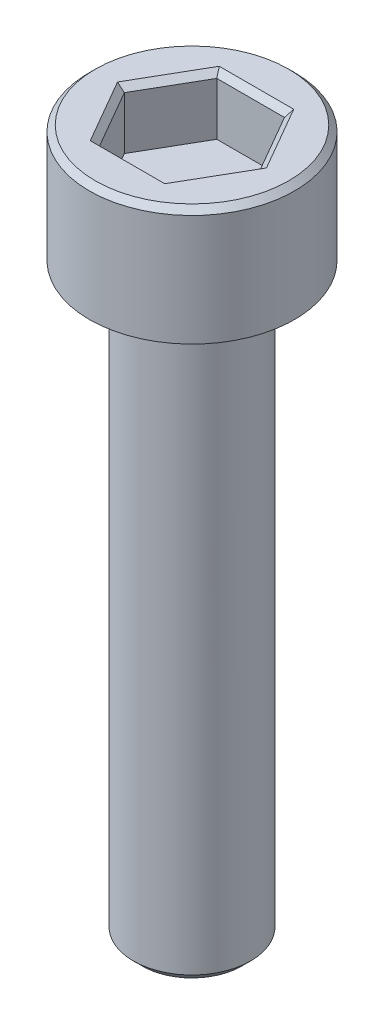
ISO-10303-21;
HEADER;
FILE_DESCRIPTION(('STEP AP214'),'2;1');
FILE_NAME('part.step','',(''),(''),'','','');
FILE_SCHEMA(('AUTOMOTIVE_DESIGN { 1 0 10303 214 1 1 1 1 }'));
ENDSEC;
DATA;
#1=APPLICATION_CONTEXT('core data for automotive mechanical design processes');
#2=APPLICATION_PROTOCOL_DEFINITION('international standard','automotive_design',2000,#1);
#3=PRODUCT_CONTEXT('',#1,'mechanical');
#4=PRODUCT('Part','Part','',(#3));
#5=PRODUCT_RELATED_PRODUCT_CATEGORY('part','',(#4));
#6=PRODUCT_DEFINITION_FORMATION('','',#4);
#7=PRODUCT_DEFINITION_CONTEXT('part definition',#1,'design');
#8=PRODUCT_DEFINITION('design','',#6,#7);
#9=PRODUCT_DEFINITION_SHAPE('','',#8);
#10=(LENGTH_UNIT() NAMED_UNIT(*) SI_UNIT(.MILLI.,.METRE.));
#11=(NAMED_UNIT(*) PLANE_ANGLE_UNIT() SI_UNIT($,.RADIAN.));
#12=(NAMED_UNIT(*) SI_UNIT($,.STERADIAN.) SOLID_ANGLE_UNIT());
#13=UNCERTAINTY_MEASURE_WITH_UNIT(LENGTH_MEASURE(1.E-05),#10,'distance_accuracy_value','');
#14=(GEOMETRIC_REPRESENTATION_CONTEXT(3) GLOBAL_UNCERTAINTY_ASSIGNED_CONTEXT((#13)) GLOBAL_UNIT_ASSIGNED_CONTEXT((#10,
#11,#12)) REPRESENTATION_CONTEXT('',''));
#15=CARTESIAN_POINT('',(0.,0.,0.));
#16=DIRECTION('',(0.,0.,1.));
#17=DIRECTION('',(1.,0.,0.));
#18=AXIS2_PLACEMENT_3D('',#15,#16,#17);
#19=CARTESIAN_POINT('',(0.,4.,0.));
#20=DIRECTION('',(0.,-1.,0.));
#21=DIRECTION('',(0.,0.,-1.));
#22=AXIS2_PLACEMENT_3D('',#19,#20,#21);
#23=CYLINDRICAL_SURFACE('',#22,3.5);
#24=CARTESIAN_POINT('',(0.,3.8,0.));
#25=DIRECTION('',(0.,1.,0.));
#26=DIRECTION('',(0.,0.,1.));
#27=AXIS2_PLACEMENT_3D('',#24,#25,#26);
#28=CIRCLE('',#27,3.5);
#29=CARTESIAN_POINT('',(0.,3.8,3.5));
#30=VERTEX_POINT('',#29);
#31=EDGE_CURVE('E180',#30,#30,#28,.F.);
#32=ORIENTED_EDGE('',*,*,#31,.T.);
#33=EDGE_LOOP('',(#32));
#34=FACE_BOUND('',#33,.T.);
#35=CARTESIAN_POINT('',(0.,0.,0.));
#36=DIRECTION('',(0.,1.,0.));
#37=DIRECTION('',(0.,0.,1.));
#38=AXIS2_PLACEMENT_3D('',#35,#36,#37);
#39=CIRCLE('',#38,3.5);
#40=CARTESIAN_POINT('',(0.,0.,3.5));
#41=VERTEX_POINT('',#40);
#42=EDGE_CURVE('E150',#41,#41,#39,.T.);
#43=ORIENTED_EDGE('',*,*,#42,.T.);
#44=EDGE_LOOP('',(#43));
#45=FACE_BOUND('',#44,.T.);
#46=ADVANCED_FACE('F37',(#34,#45),#23,.T.);
#47=CARTESIAN_POINT('',(0.,4.,0.));
#48=DIRECTION('',(0.,1.,0.));
#49=DIRECTION('',(0.,0.,1.));
#50=AXIS2_PLACEMENT_3D('',#47,#48,#49);
#51=PLANE('',#50);
#52=CARTESIAN_POINT('',(0.,4.,0.));
#53=DIRECTION('',(0.,1.,0.));
#54=DIRECTION('',(0.,0.,1.));
#55=AXIS2_PLACEMENT_3D('',#52,#53,#54);
#56=CIRCLE('',#55,3.3);
#57=CARTESIAN_POINT('',(0.,4.,3.3));
#58=VERTEX_POINT('',#57);
#59=EDGE_CURVE('E177',#58,#58,#56,.T.);
#60=ORIENTED_EDGE('',*,*,#59,.T.);
#61=EDGE_LOOP('',(#60));
#62=FACE_BOUND('',#61,.T.);
#63=DIRECTION('',(0.500109828527989,0.,-0.865961984967992));
#64=VECTOR('',#63,1.);
#65=CARTESIAN_POINT('',(-1.32763927867956,4.,-2.10016839302008));
#66=LINE('',#65,#64);
#67=CARTESIAN_POINT('',(-2.54034116400461,4.,-0.000322175477219859));
#68=VERTEX_POINT('',#67);
#69=CARTESIAN_POINT('',(-1.26989156985456,4.,-2.20016107004593));
#70=VERTEX_POINT('',#69);
#71=EDGE_CURVE('E172',#68,#70,#66,.T.);
#72=ORIENTED_EDGE('',*,*,#71,.T.);
#73=DIRECTION('',(0.999999991957874,0.,0.00012682370352176));
#74=VECTOR('',#73,1.);
#75=CARTESIAN_POINT('',(1.15497954124075,4.,-2.19985353890858));
#76=LINE('',#75,#74);
#77=CARTESIAN_POINT('',(1.27044959415005,4.,-2.19983889456871));
#78=VERTEX_POINT('',#77);
#79=EDGE_CURVE('E174',#70,#78,#76,.T.);
#80=ORIENTED_EDGE('',*,*,#79,.T.);
#81=DIRECTION('',(0.499890163429886,0.,0.866088808671514));
#82=VECTOR('',#81,1.);
#83=CARTESIAN_POINT('',(2.48261881992031,4.,-0.0996851458885045));
#84=LINE('',#83,#82);
#85=CARTESIAN_POINT('',(2.54034116400461,4.,0.000322175477217571));
#86=VERTEX_POINT('',#85);
#87=EDGE_CURVE('E164',#78,#86,#84,.T.);
#88=ORIENTED_EDGE('',*,*,#87,.T.);
#89=DIRECTION('',(-0.500109828527989,0.,0.865961984967992));
#90=VECTOR('',#89,1.);
#91=CARTESIAN_POINT('',(1.32763927867956,4.,2.10016839302008));
#92=LINE('',#91,#90);
#93=CARTESIAN_POINT('',(1.26989156985455,4.,2.20016107004593));
#94=VERTEX_POINT('',#93);
#95=EDGE_CURVE('E166',#86,#94,#92,.T.);
#96=ORIENTED_EDGE('',*,*,#95,.T.);
#97=DIRECTION('',(-0.999999991957874,0.,-0.000126823703521948));
#98=VECTOR('',#97,1.);
#99=CARTESIAN_POINT('',(-1.15497954124075,4.,2.19985353890858));
#100=LINE('',#99,#98);
#101=CARTESIAN_POINT('',(-1.27044959415005,4.,2.19983889456871));
#102=VERTEX_POINT('',#101);
#103=EDGE_CURVE('E168',#94,#102,#100,.T.);
#104=ORIENTED_EDGE('',*,*,#103,.T.);
#105=DIRECTION('',(-0.499890163429885,0.,-0.866088808671514));
#106=VECTOR('',#105,1.);
#107=CARTESIAN_POINT('',(-2.48261881992031,4.,0.0996851458885031));
#108=LINE('',#107,#106);
#109=EDGE_CURVE('E170',#102,#68,#108,.T.);
#110=ORIENTED_EDGE('',*,*,#109,.T.);
#111=EDGE_LOOP('',(#72,#80,#88,#96,#104,#110));
#112=FACE_BOUND('',#111,.T.);
#113=ADVANCED_FACE('F219',(#62,#112),#51,.T.);
#114=CARTESIAN_POINT('',(0.,0.,0.));
#115=DIRECTION('',(0.,1.,0.));
#116=DIRECTION('',(0.,0.,1.));
#117=AXIS2_PLACEMENT_3D('',#114,#115,#116);
#118=PLANE('',#117);
#119=CARTESIAN_POINT('',(0.,0.,0.));
#120=DIRECTION('',(0.,1.,0.));
#121=DIRECTION('',(0.,0.,1.));
#122=AXIS2_PLACEMENT_3D('',#119,#120,#121);
#123=CIRCLE('',#122,2.);
#124=CARTESIAN_POINT('',(0.,0.,2.));
#125=VERTEX_POINT('',#124);
#126=EDGE_CURVE('E161',#125,#125,#123,.F.);
#127=ORIENTED_EDGE('',*,*,#126,.F.);
#128=EDGE_LOOP('',(#127));
#129=FACE_BOUND('',#128,.T.);
#130=ORIENTED_EDGE('',*,*,#42,.F.);
#131=EDGE_LOOP('',(#130));
#132=FACE_BOUND('',#131,.T.);
#133=ADVANCED_FACE('F225',(#129,#132),#118,.F.);
#134=CARTESIAN_POINT('',(0.,-20.,0.));
#135=DIRECTION('',(0.,1.,0.));
#136=DIRECTION('',(0.,0.,1.));
#137=AXIS2_PLACEMENT_3D('',#134,#135,#136);
#138=CYLINDRICAL_SURFACE('',#137,2.);
#139=CARTESIAN_POINT('',(0.,-19.7,0.));
#140=DIRECTION('',(0.,-1.,0.));
#141=DIRECTION('',(0.,0.,-1.));
#142=AXIS2_PLACEMENT_3D('',#139,#140,#141);
#143=CIRCLE('',#142,2.);
#144=CARTESIAN_POINT('',(0.,-19.7,-2.));
#145=VERTEX_POINT('',#144);
#146=EDGE_CURVE('E11',#145,#145,#143,.F.);
#147=ORIENTED_EDGE('',*,*,#146,.T.);
#148=EDGE_LOOP('',(#147));
#149=FACE_BOUND('',#148,.T.);
#150=ORIENTED_EDGE('',*,*,#126,.T.);
#151=EDGE_LOOP('',(#150));
#152=FACE_BOUND('',#151,.T.);
#153=ADVANCED_FACE('F295',(#149,#152),#138,.T.);
#154=CARTESIAN_POINT('',(0.,-20.,0.));
#155=DIRECTION('',(0.,-1.,0.));
#156=DIRECTION('',(0.,0.,-1.));
#157=AXIS2_PLACEMENT_3D('',#154,#155,#156);
#158=PLANE('',#157);
#159=CARTESIAN_POINT('',(0.,-20.,0.));
#160=DIRECTION('',(0.,-1.,0.));
#161=DIRECTION('',(0.,0.,-1.));
#162=AXIS2_PLACEMENT_3D('',#159,#160,#161);
#163=CIRCLE('',#162,1.7);
#164=CARTESIAN_POINT('',(0.,-20.,-1.7));
#165=VERTEX_POINT('',#164);
#166=EDGE_CURVE('E45',#165,#165,#163,.T.);
#167=ORIENTED_EDGE('',*,*,#166,.T.);
#168=EDGE_LOOP('',(#167));
#169=FACE_BOUND('',#168,.T.);
#170=ADVANCED_FACE('F206',(#169),#158,.T.);
#171=CARTESIAN_POINT('',(2.30940105818601,2.,0.000292886797471428));
#172=DIRECTION('',(0.866088808671514,0.,-0.499890163429886));
#173=DIRECTION('',(-0.499890163429886,0.,-0.866088808671514));
#174=AXIS2_PLACEMENT_3D('',#171,#172,#173);
#175=PLANE('',#174);
#176=DIRECTION('',(0.,1.,0.));
#177=VECTOR('',#176,1.);
#178=CARTESIAN_POINT('',(2.30940105818601,2.,0.000292886797471428));
#179=LINE('',#178,#177);
#180=CARTESIAN_POINT('',(2.30940105818601,2.,0.000292886797471428));
#181=VERTEX_POINT('',#180);
#182=CARTESIAN_POINT('',(2.30940105818601,3.8,0.000292886797471428));
#183=VERTEX_POINT('',#182);
#184=EDGE_CURVE('E148',#181,#183,#179,.T.);
#185=ORIENTED_EDGE('',*,*,#184,.T.);
#186=DIRECTION('',(-0.499890163429886,0.,-0.866088808671514));
#187=VECTOR('',#186,1.);
#188=CARTESIAN_POINT('',(1.15495417650005,3.8,-1.99985354051701));
#189=LINE('',#188,#187);
#190=CARTESIAN_POINT('',(1.15495417650005,3.8,-1.99985354051701));
#191=VERTEX_POINT('',#190);
#192=EDGE_CURVE('E116',#183,#191,#189,.T.);
#193=ORIENTED_EDGE('',*,*,#192,.T.);
#194=DIRECTION('',(0.,1.,0.));
#195=VECTOR('',#194,1.);
#196=CARTESIAN_POINT('',(1.15495417650005,2.,-1.99985354051701));
#197=LINE('',#196,#195);
#198=CARTESIAN_POINT('',(1.15495417650005,2.,-1.99985354051701));
#199=VERTEX_POINT('',#198);
#200=EDGE_CURVE('E109',#199,#191,#197,.T.);
#201=ORIENTED_EDGE('',*,*,#200,.F.);
#202=DIRECTION('',(-0.499890163429885,0.,-0.866088808671514));
#203=VECTOR('',#202,1.);
#204=CARTESIAN_POINT('',(2.30940105818601,2.,0.000292886797471428));
#205=LINE('',#204,#203);
#206=EDGE_CURVE('E113',#181,#199,#205,.T.);
#207=ORIENTED_EDGE('',*,*,#206,.F.);
#208=EDGE_LOOP('',(#185,#193,#201,#207));
#209=FACE_BOUND('',#208,.T.);
#210=ADVANCED_FACE('F111',(#209),#175,.F.);
#211=CARTESIAN_POINT('',(1.15444688168596,2.,2.00014642731448));
#212=DIRECTION('',(0.865961984967992,0.,0.500109828527989));
#213=DIRECTION('',(0.500109828527989,0.,-0.865961984967992));
#214=AXIS2_PLACEMENT_3D('',#211,#212,#213);
#215=PLANE('',#214);
#216=DIRECTION('',(0.,1.,0.));
#217=VECTOR('',#216,1.);
#218=CARTESIAN_POINT('',(1.15444688168596,2.,2.00014642731448));
#219=LINE('',#218,#217);
#220=CARTESIAN_POINT('',(1.15444688168596,2.,2.00014642731448));
#221=VERTEX_POINT('',#220);
#222=CARTESIAN_POINT('',(1.15444688168596,3.8,2.00014642731448));
#223=VERTEX_POINT('',#222);
#224=EDGE_CURVE('E151',#221,#223,#219,.T.);
#225=ORIENTED_EDGE('',*,*,#224,.T.);
#226=DIRECTION('',(0.500109828527989,0.,-0.865961984967992));
#227=VECTOR('',#226,1.);
#228=CARTESIAN_POINT('',(2.30940105818601,3.8,0.000292886797471372));
#229=LINE('',#228,#227);
#230=EDGE_CURVE('E52',#223,#183,#229,.T.);
#231=ORIENTED_EDGE('',*,*,#230,.T.);
#232=ORIENTED_EDGE('',*,*,#184,.F.);
#233=DIRECTION('',(0.500109828527989,0.,-0.865961984967992));
#234=VECTOR('',#233,1.);
#235=CARTESIAN_POINT('',(1.15444688168596,2.,2.00014642731448));
#236=LINE('',#235,#234);
#237=EDGE_CURVE('E121',#221,#181,#236,.T.);
#238=ORIENTED_EDGE('',*,*,#237,.F.);
#239=EDGE_LOOP('',(#225,#231,#232,#238));
#240=FACE_BOUND('',#239,.T.);
#241=ADVANCED_FACE('F276',(#240),#215,.F.);
#242=CARTESIAN_POINT('',(-1.15495417650005,2.,1.99985354051701));
#243=DIRECTION('',(-0.000126823703521948,0.,0.999999991957874));
#244=DIRECTION('',(0.999999991957874,0.,0.000126823703521948));
#245=AXIS2_PLACEMENT_3D('',#242,#243,#244);
#246=PLANE('',#245);
#247=DIRECTION('',(0.,1.,0.));
#248=VECTOR('',#247,1.);
#249=CARTESIAN_POINT('',(-1.15495417650005,2.,1.99985354051701));
#250=LINE('',#249,#248);
#251=CARTESIAN_POINT('',(-1.15495417650005,2.,1.99985354051701));
#252=VERTEX_POINT('',#251);
#253=CARTESIAN_POINT('',(-1.15495417650005,3.8,1.99985354051701));
#254=VERTEX_POINT('',#253);
#255=EDGE_CURVE('E153',#252,#254,#250,.T.);
#256=ORIENTED_EDGE('',*,*,#255,.T.);
#257=DIRECTION('',(0.999999991957874,0.,0.000126823703521948));
#258=VECTOR('',#257,1.);
#259=CARTESIAN_POINT('',(1.15444688168596,3.8,2.00014642731448));
#260=LINE('',#259,#258);
#261=EDGE_CURVE('E60',#254,#223,#260,.T.);
#262=ORIENTED_EDGE('',*,*,#261,.T.);
#263=ORIENTED_EDGE('',*,*,#224,.F.);
#264=DIRECTION('',(0.999999991957874,0.,0.000126823703521948));
#265=VECTOR('',#264,1.);
#266=CARTESIAN_POINT('',(-1.15495417650005,2.,1.99985354051701));
#267=LINE('',#266,#265);
#268=EDGE_CURVE('E145',#252,#221,#267,.T.);
#269=ORIENTED_EDGE('',*,*,#268,.F.);
#270=EDGE_LOOP('',(#256,#262,#263,#269));
#271=FACE_BOUND('',#270,.T.);
#272=ADVANCED_FACE('F275',(#271),#246,.F.);
#273=CARTESIAN_POINT('',(-2.30940105818601,2.,-0.00029288679747257));
#274=DIRECTION('',(-0.866088808671514,0.,0.499890163429885));
#275=DIRECTION('',(0.499890163429885,0.,0.866088808671514));
#276=AXIS2_PLACEMENT_3D('',#273,#274,#275);
#277=PLANE('',#276);
#278=DIRECTION('',(0.,1.,0.));
#279=VECTOR('',#278,1.);
#280=CARTESIAN_POINT('',(-2.30940105818601,2.,-0.00029288679747257));
#281=LINE('',#280,#279);
#282=CARTESIAN_POINT('',(-2.30940105818601,2.,-0.00029288679747257));
#283=VERTEX_POINT('',#282);
#284=CARTESIAN_POINT('',(-2.30940105818601,3.8,-0.00029288679747257));
#285=VERTEX_POINT('',#284);
#286=EDGE_CURVE('E155',#283,#285,#281,.T.);
#287=ORIENTED_EDGE('',*,*,#286,.T.);
#288=DIRECTION('',(0.499890163429885,0.,0.866088808671514));
#289=VECTOR('',#288,1.);
#290=CARTESIAN_POINT('',(-1.15495417650005,3.8,1.99985354051701));
#291=LINE('',#290,#289);
#292=EDGE_CURVE('E187',#285,#254,#291,.T.);
#293=ORIENTED_EDGE('',*,*,#292,.T.);
#294=ORIENTED_EDGE('',*,*,#255,.F.);
#295=DIRECTION('',(0.499890163429885,0.,0.866088808671514));
#296=VECTOR('',#295,1.);
#297=CARTESIAN_POINT('',(-2.30940105818601,2.,-0.00029288679747257));
#298=LINE('',#297,#296);
#299=EDGE_CURVE('E142',#283,#252,#298,.T.);
#300=ORIENTED_EDGE('',*,*,#299,.F.);
#301=EDGE_LOOP('',(#287,#293,#294,#300));
#302=FACE_BOUND('',#301,.T.);
#303=ADVANCED_FACE('F274',(#302),#277,.F.);
#304=CARTESIAN_POINT('',(-1.15444688168596,2.,-2.00014642731448));
#305=DIRECTION('',(-0.865961984967992,0.,-0.500109828527989));
#306=DIRECTION('',(-0.500109828527989,0.,0.865961984967992));
#307=AXIS2_PLACEMENT_3D('',#304,#305,#306);
#308=PLANE('',#307);
#309=DIRECTION('',(0.,1.,0.));
#310=VECTOR('',#309,1.);
#311=CARTESIAN_POINT('',(-1.15444688168596,2.,-2.00014642731448));
#312=LINE('',#311,#310);
#313=CARTESIAN_POINT('',(-1.15444688168596,2.,-2.00014642731448));
#314=VERTEX_POINT('',#313);
#315=CARTESIAN_POINT('',(-1.15444688168596,3.8,-2.00014642731448));
#316=VERTEX_POINT('',#315);
#317=EDGE_CURVE('E120',#314,#316,#312,.T.);
#318=ORIENTED_EDGE('',*,*,#317,.T.);
#319=DIRECTION('',(-0.500109828527989,0.,0.865961984967992));
#320=VECTOR('',#319,1.);
#321=CARTESIAN_POINT('',(-2.30940105818601,3.8,-0.000292886797472452));
#322=LINE('',#321,#320);
#323=EDGE_CURVE('E185',#316,#285,#322,.T.);
#324=ORIENTED_EDGE('',*,*,#323,.T.);
#325=ORIENTED_EDGE('',*,*,#286,.F.);
#326=DIRECTION('',(-0.500109828527989,0.,0.865961984967992));
#327=VECTOR('',#326,1.);
#328=CARTESIAN_POINT('',(-1.15444688168596,2.,-2.00014642731448));
#329=LINE('',#328,#327);
#330=EDGE_CURVE('E130',#314,#283,#329,.T.);
#331=ORIENTED_EDGE('',*,*,#330,.F.);
#332=EDGE_LOOP('',(#318,#324,#325,#331));
#333=FACE_BOUND('',#332,.T.);
#334=ADVANCED_FACE('F270',(#333),#308,.F.);
#335=CARTESIAN_POINT('',(1.15495417650005,2.,-1.99985354051701));
#336=DIRECTION('',(0.00012682370352176,0.,-0.999999991957874));
#337=DIRECTION('',(-0.999999991957874,0.,-0.00012682370352176));
#338=AXIS2_PLACEMENT_3D('',#335,#336,#337);
#339=PLANE('',#338);
#340=ORIENTED_EDGE('',*,*,#200,.T.);
#341=DIRECTION('',(-0.999999991957874,0.,-0.00012682370352176));
#342=VECTOR('',#341,1.);
#343=CARTESIAN_POINT('',(-1.15444688168596,3.8,-2.00014642731448));
#344=LINE('',#343,#342);
#345=EDGE_CURVE('E183',#191,#316,#344,.T.);
#346=ORIENTED_EDGE('',*,*,#345,.T.);
#347=ORIENTED_EDGE('',*,*,#317,.F.);
#348=DIRECTION('',(-0.999999991957874,0.,-0.00012682370352176));
#349=VECTOR('',#348,1.);
#350=CARTESIAN_POINT('',(1.15495417650005,2.,-1.99985354051701));
#351=LINE('',#350,#349);
#352=EDGE_CURVE('E124',#199,#314,#351,.T.);
#353=ORIENTED_EDGE('',*,*,#352,.F.);
#354=EDGE_LOOP('',(#340,#346,#347,#353));
#355=FACE_BOUND('',#354,.T.);
#356=ADVANCED_FACE('F125',(#355),#339,.F.);
#357=CARTESIAN_POINT('',(0.,2.,0.));
#358=DIRECTION('',(0.,1.,0.));
#359=DIRECTION('',(0.,0.,1.));
#360=AXIS2_PLACEMENT_3D('',#357,#358,#359);
#361=PLANE('',#360);
#362=ORIENTED_EDGE('',*,*,#206,.T.);
#363=ORIENTED_EDGE('',*,*,#352,.T.);
#364=ORIENTED_EDGE('',*,*,#330,.T.);
#365=ORIENTED_EDGE('',*,*,#299,.T.);
#366=ORIENTED_EDGE('',*,*,#268,.T.);
#367=ORIENTED_EDGE('',*,*,#237,.T.);
#368=EDGE_LOOP('',(#362,#363,#364,#365,#366,#367));
#369=FACE_BOUND('',#368,.T.);
#370=ADVANCED_FACE('F132',(#369),#361,.T.);
#371=CARTESIAN_POINT('',(0.,4.,0.));
#372=DIRECTION('',(0.,-1.,0.));
#373=DIRECTION('',(0.,0.,-1.));
#374=AXIS2_PLACEMENT_3D('',#371,#372,#373);
#375=CONICAL_SURFACE('',#374,3.3,0.785398163397445);
#376=ORIENTED_EDGE('',*,*,#31,.F.);
#377=EDGE_LOOP('',(#376));
#378=FACE_BOUND('',#377,.T.);
#379=ORIENTED_EDGE('',*,*,#59,.F.);
#380=EDGE_LOOP('',(#379));
#381=FACE_BOUND('',#380,.T.);
#382=ADVANCED_FACE('F231',(#378,#381),#375,.T.);
#383=CARTESIAN_POINT('',(-1.15495417650005,3.8,1.99985354051701));
#384=DIRECTION('',(8.96779007755612E-05,0.707106781186551,-0.707106775499903));
#385=DIRECTION('',(-0.999999991957874,0.,-0.000126823703521948));
#386=AXIS2_PLACEMENT_3D('',#383,#384,#385);
#387=PLANE('',#386);
#388=DIRECTION('',(-0.378047495572634,0.654653670707974,0.654605730588905));
#389=VECTOR('',#388,1.);
#390=CARTESIAN_POINT('',(-0.824967268928603,3.22857142857143,1.428466814655));
#391=LINE('',#390,#389);
#392=EDGE_CURVE('E138',#102,#254,#391,.F.);
#393=ORIENTED_EDGE('',*,*,#392,.F.);
#394=ORIENTED_EDGE('',*,*,#103,.F.);
#395=DIRECTION('',(0.377881444366547,0.654653670707974,0.654701600297439));
#396=VECTOR('',#395,1.);
#397=CARTESIAN_POINT('',(0.82460491548997,3.22857142857144,1.42867601951034));
#398=LINE('',#397,#396);
#399=EDGE_CURVE('E135',#223,#94,#398,.T.);
#400=ORIENTED_EDGE('',*,*,#399,.F.);
#401=ORIENTED_EDGE('',*,*,#261,.F.);
#402=EDGE_LOOP('',(#393,#394,#400,#401));
#403=FACE_BOUND('',#402,.T.);
#404=ADVANCED_FACE('F233',(#403),#387,.T.);
#405=CARTESIAN_POINT('',(1.15444688168596,3.8,2.00014642731448));
#406=DIRECTION('',(-0.612327591820628,0.70710678118655,-0.353631051090181));
#407=DIRECTION('',(-0.500109828527989,0.,0.865961984967992));
#408=AXIS2_PLACEMENT_3D('',#405,#406,#407);
#409=PLANE('',#408);
#410=ORIENTED_EDGE('',*,*,#399,.T.);
#411=ORIENTED_EDGE('',*,*,#95,.F.);
#412=DIRECTION('',(0.755928939939182,0.654653670707974,9.58697085308018E-05));
#413=VECTOR('',#412,1.);
#414=CARTESIAN_POINT('',(1.64957218441857,3.22857142857143,0.000209204855338568));
#415=LINE('',#414,#413);
#416=EDGE_CURVE('E199',#183,#86,#415,.T.);
#417=ORIENTED_EDGE('',*,*,#416,.F.);
#418=ORIENTED_EDGE('',*,*,#230,.F.);
#419=EDGE_LOOP('',(#410,#411,#417,#418));
#420=FACE_BOUND('',#419,.T.);
#421=ADVANCED_FACE('F246',(#420),#409,.T.);
#422=CARTESIAN_POINT('',(-2.30940105818601,3.8,-0.00029288679747257));
#423=DIRECTION('',(0.612417269721403,0.707106781186551,-0.353475724409722));
#424=DIRECTION('',(-0.499890163429885,0.,-0.866088808671514));
#425=AXIS2_PLACEMENT_3D('',#422,#423,#424);
#426=PLANE('',#425);
#427=ORIENTED_EDGE('',*,*,#392,.T.);
#428=ORIENTED_EDGE('',*,*,#292,.F.);
#429=DIRECTION('',(-0.755928939939182,0.654653670707973,-9.58697085338086E-05));
#430=VECTOR('',#429,1.);
#431=CARTESIAN_POINT('',(-1.64957218441857,3.22857142857143,-0.000209204855337267));
#432=LINE('',#431,#430);
#433=EDGE_CURVE('E196',#68,#285,#432,.F.);
#434=ORIENTED_EDGE('',*,*,#433,.F.);
#435=ORIENTED_EDGE('',*,*,#109,.F.);
#436=EDGE_LOOP('',(#427,#428,#434,#435));
#437=FACE_BOUND('',#436,.T.);
#438=ADVANCED_FACE('F242',(#437),#426,.T.);
#439=CARTESIAN_POINT('',(2.30940105818601,3.8,0.000292886797471428));
#440=DIRECTION('',(-0.612417269721402,0.707106781186552,0.353475724409721));
#441=DIRECTION('',(0.499890163429886,0.,0.866088808671514));
#442=AXIS2_PLACEMENT_3D('',#439,#440,#441);
#443=PLANE('',#442);
#444=ORIENTED_EDGE('',*,*,#416,.T.);
#445=ORIENTED_EDGE('',*,*,#87,.F.);
#446=DIRECTION('',(-0.378047495572634,-0.654653670707973,0.654605730588907));
#447=VECTOR('',#446,1.);
#448=CARTESIAN_POINT('',(1.15495417650005,3.8,-1.99985354051701));
#449=LINE('',#448,#447);
#450=EDGE_CURVE('E194',#191,#78,#449,.F.);
#451=ORIENTED_EDGE('',*,*,#450,.F.);
#452=ORIENTED_EDGE('',*,*,#192,.F.);
#453=EDGE_LOOP('',(#444,#445,#451,#452));
#454=FACE_BOUND('',#453,.T.);
#455=ADVANCED_FACE('F238',(#454),#443,.T.);
#456=CARTESIAN_POINT('',(-1.15444688168596,3.8,-2.00014642731448));
#457=DIRECTION('',(0.612327591820627,0.707106781186551,0.353631051090181));
#458=DIRECTION('',(0.500109828527989,0.,-0.865961984967992));
#459=AXIS2_PLACEMENT_3D('',#456,#457,#458);
#460=PLANE('',#459);
#461=ORIENTED_EDGE('',*,*,#433,.T.);
#462=ORIENTED_EDGE('',*,*,#323,.F.);
#463=DIRECTION('',(-0.377881444366547,0.654653670707973,-0.65470160029744));
#464=VECTOR('',#463,1.);
#465=CARTESIAN_POINT('',(-0.824604915489971,3.22857142857144,-1.42867601951034));
#466=LINE('',#465,#464);
#467=EDGE_CURVE('E192',#70,#316,#466,.F.);
#468=ORIENTED_EDGE('',*,*,#467,.F.);
#469=ORIENTED_EDGE('',*,*,#71,.F.);
#470=EDGE_LOOP('',(#461,#462,#468,#469));
#471=FACE_BOUND('',#470,.T.);
#472=ADVANCED_FACE('F214',(#471),#460,.T.);
#473=CARTESIAN_POINT('',(1.15495417650005,3.8,-1.99985354051701));
#474=DIRECTION('',(-8.96779007754283E-05,0.707106781186552,0.707106775499902));
#475=DIRECTION('',(0.999999991957874,0.,0.00012682370352176));
#476=AXIS2_PLACEMENT_3D('',#473,#474,#475);
#477=PLANE('',#476);
#478=ORIENTED_EDGE('',*,*,#450,.T.);
#479=ORIENTED_EDGE('',*,*,#79,.F.);
#480=ORIENTED_EDGE('',*,*,#467,.T.);
#481=ORIENTED_EDGE('',*,*,#345,.F.);
#482=EDGE_LOOP('',(#478,#479,#480,#481));
#483=FACE_BOUND('',#482,.T.);
#484=ADVANCED_FACE('F209',(#483),#477,.T.);
#485=CARTESIAN_POINT('',(0.,-20.,0.));
#486=DIRECTION('',(0.,1.,0.));
#487=DIRECTION('',(0.,0.,1.));
#488=AXIS2_PLACEMENT_3D('',#485,#486,#487);
#489=CONICAL_SURFACE('',#488,1.7,0.785398163397445);
#490=ORIENTED_EDGE('',*,*,#146,.F.);
#491=EDGE_LOOP('',(#490));
#492=FACE_BOUND('',#491,.T.);
#493=ORIENTED_EDGE('',*,*,#166,.F.);
#494=EDGE_LOOP('',(#493));
#495=FACE_BOUND('',#494,.T.);
#496=ADVANCED_FACE('F39',(#492,#495),#489,.T.);
#497=CLOSED_SHELL('',(#46,#113,#133,#153,#170,#210,#241,#272,#303,#334,#356,#370,#382,#404,#421,
#438,#455,#472,#484,#496));
#498=MANIFOLD_SOLID_BREP('B2',#497);
#499=ADVANCED_BREP_SHAPE_REPRESENTATION('',(#18,#498),#14);
#500=SHAPE_DEFINITION_REPRESENTATION(#9,#499);
ENDSEC;
END-ISO-10303-21;
